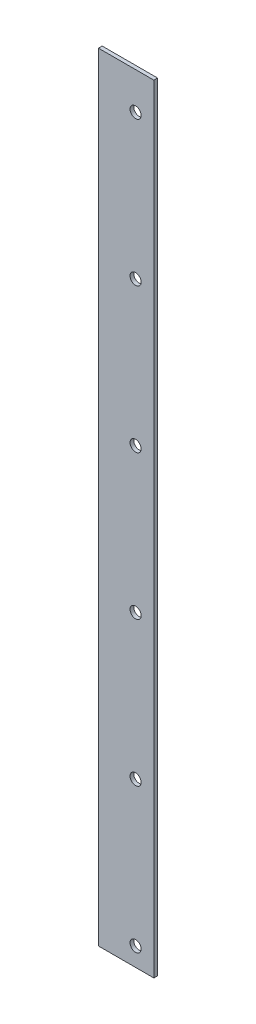
ISO-10303-21;
HEADER;
FILE_DESCRIPTION(('STEP AP214'),'2;1');
FILE_NAME('part.step','',(''),(''),'','','');
FILE_SCHEMA(('AUTOMOTIVE_DESIGN { 1 0 10303 214 1 1 1 1 }'));
ENDSEC;
DATA;
#1=APPLICATION_CONTEXT('core data for automotive mechanical design processes');
#2=APPLICATION_PROTOCOL_DEFINITION('international standard','automotive_design',2000,#1);
#3=PRODUCT_CONTEXT('',#1,'mechanical');
#4=PRODUCT('Part','Part','',(#3));
#5=PRODUCT_RELATED_PRODUCT_CATEGORY('part','',(#4));
#6=PRODUCT_DEFINITION_FORMATION('','',#4);
#7=PRODUCT_DEFINITION_CONTEXT('part definition',#1,'design');
#8=PRODUCT_DEFINITION('design','',#6,#7);
#9=PRODUCT_DEFINITION_SHAPE('','',#8);
#10=(LENGTH_UNIT() NAMED_UNIT(*) SI_UNIT(.MILLI.,.METRE.));
#11=(NAMED_UNIT(*) PLANE_ANGLE_UNIT() SI_UNIT($,.RADIAN.));
#12=(NAMED_UNIT(*) SI_UNIT($,.STERADIAN.) SOLID_ANGLE_UNIT());
#13=UNCERTAINTY_MEASURE_WITH_UNIT(LENGTH_MEASURE(1.E-05),#10,'distance_accuracy_value','');
#14=(GEOMETRIC_REPRESENTATION_CONTEXT(3) GLOBAL_UNCERTAINTY_ASSIGNED_CONTEXT((#13)) GLOBAL_UNIT_ASSIGNED_CONTEXT((#10,
#11,#12)) REPRESENTATION_CONTEXT('',''));
#15=CARTESIAN_POINT('',(0.,0.,0.));
#16=DIRECTION('',(0.,0.,1.));
#17=DIRECTION('',(1.,0.,0.));
#18=AXIS2_PLACEMENT_3D('',#15,#16,#17);
#19=CARTESIAN_POINT('',(11558.6922390228,488.999999999901,26699.8257165079));
#20=DIRECTION('',(0.,0.,-1.));
#21=DIRECTION('',(-1.,0.,0.));
#22=AXIS2_PLACEMENT_3D('',#19,#20,#21);
#23=PLANE('',#22);
#24=DIRECTION('',(1.,0.,0.));
#25=VECTOR('',#24,1.);
#26=CARTESIAN_POINT('',(11543.6922390228,910.,26699.8257165079));
#27=LINE('',#26,#25);
#28=CARTESIAN_POINT('',(11558.6922390228,910.,26699.8257165079));
#29=VERTEX_POINT('',#28);
#30=CARTESIAN_POINT('',(11528.6922390228,910.,26699.8257165079));
#31=VERTEX_POINT('',#30);
#32=EDGE_CURVE('E72',#29,#31,#27,.F.);
#33=ORIENTED_EDGE('',*,*,#32,.F.);
#34=DIRECTION('',(0.,1.,0.));
#35=VECTOR('',#34,1.);
#36=CARTESIAN_POINT('',(11558.6922390228,488.999999999901,26699.8257165079));
#37=LINE('',#36,#35);
#38=CARTESIAN_POINT('',(11558.6922390228,488.999999999901,26699.8257165079));
#39=VERTEX_POINT('',#38);
#40=EDGE_CURVE('E55',#39,#29,#37,.T.);
#41=ORIENTED_EDGE('',*,*,#40,.F.);
#42=DIRECTION('',(1.,0.,0.));
#43=VECTOR('',#42,1.);
#44=CARTESIAN_POINT('',(11543.6922390228,488.999999999901,26699.8257165079));
#45=LINE('',#44,#43);
#46=CARTESIAN_POINT('',(11528.6922390228,488.999999999901,26699.8257165079));
#47=VERTEX_POINT('',#46);
#48=EDGE_CURVE('E60',#39,#47,#45,.F.);
#49=ORIENTED_EDGE('',*,*,#48,.T.);
#50=DIRECTION('',(0.,1.,0.));
#51=VECTOR('',#50,1.);
#52=CARTESIAN_POINT('',(11528.6922390228,488.999999999901,26699.8257165079));
#53=LINE('',#52,#51);
#54=EDGE_CURVE('E102',#31,#47,#53,.F.);
#55=ORIENTED_EDGE('',*,*,#54,.F.);
#56=EDGE_LOOP('',(#33,#41,#49,#55));
#57=FACE_BOUND('',#56,.T.);
#58=CARTESIAN_POINT('',(11548.8037727152,577.272727272728,26699.8257165079));
#59=DIRECTION('',(0.,0.,1.));
#60=DIRECTION('',(1.,0.,0.));
#61=AXIS2_PLACEMENT_3D('',#58,#59,#60);
#62=CIRCLE('',#61,3.00000000001032);
#63=CARTESIAN_POINT('',(11551.8037727153,577.272727272728,26699.8257165079));
#64=VERTEX_POINT('',#63);
#65=EDGE_CURVE('E69',#64,#64,#62,.T.);
#66=ORIENTED_EDGE('',*,*,#65,.T.);
#67=EDGE_LOOP('',(#66));
#68=FACE_BOUND('',#67,.T.);
#69=CARTESIAN_POINT('',(11548.8037727153,733.636363636364,26699.8257165079));
#70=DIRECTION('',(0.,0.,1.));
#71=DIRECTION('',(1.,0.,0.));
#72=AXIS2_PLACEMENT_3D('',#69,#70,#71);
#73=CIRCLE('',#72,3.00000000001032);
#74=CARTESIAN_POINT('',(11551.8037727153,733.636363636364,26699.8257165079));
#75=VERTEX_POINT('',#74);
#76=EDGE_CURVE('E105',#75,#75,#73,.T.);
#77=ORIENTED_EDGE('',*,*,#76,.T.);
#78=EDGE_LOOP('',(#77));
#79=FACE_BOUND('',#78,.T.);
#80=CARTESIAN_POINT('',(11548.8037727152,890.,26699.8257165079));
#81=DIRECTION('',(0.,0.,1.));
#82=DIRECTION('',(1.,0.,0.));
#83=AXIS2_PLACEMENT_3D('',#80,#81,#82);
#84=CIRCLE('',#83,3.00000000001032);
#85=CARTESIAN_POINT('',(11551.8037727153,890.,26699.8257165079));
#86=VERTEX_POINT('',#85);
#87=EDGE_CURVE('E108',#86,#86,#84,.T.);
#88=ORIENTED_EDGE('',*,*,#87,.T.);
#89=EDGE_LOOP('',(#88));
#90=FACE_BOUND('',#89,.T.);
#91=CARTESIAN_POINT('',(11548.8037727152,811.818181818182,26699.8257165079));
#92=DIRECTION('',(0.,0.,1.));
#93=DIRECTION('',(1.,0.,0.));
#94=AXIS2_PLACEMENT_3D('',#91,#92,#93);
#95=CIRCLE('',#94,3.00000000001032);
#96=CARTESIAN_POINT('',(11551.8037727153,811.818181818182,26699.8257165079));
#97=VERTEX_POINT('',#96);
#98=EDGE_CURVE('E111',#97,#97,#95,.T.);
#99=ORIENTED_EDGE('',*,*,#98,.T.);
#100=EDGE_LOOP('',(#99));
#101=FACE_BOUND('',#100,.T.);
#102=CARTESIAN_POINT('',(11548.8037727152,655.454545454546,26699.8257165079));
#103=DIRECTION('',(0.,0.,1.));
#104=DIRECTION('',(1.,0.,0.));
#105=AXIS2_PLACEMENT_3D('',#102,#103,#104);
#106=CIRCLE('',#105,3.00000000001032);
#107=CARTESIAN_POINT('',(11551.8037727153,655.454545454546,26699.8257165079));
#108=VERTEX_POINT('',#107);
#109=EDGE_CURVE('E113',#108,#108,#106,.T.);
#110=ORIENTED_EDGE('',*,*,#109,.T.);
#111=EDGE_LOOP('',(#110));
#112=FACE_BOUND('',#111,.T.);
#113=CARTESIAN_POINT('',(11548.8037727152,499.090909090909,26699.8257165079));
#114=DIRECTION('',(0.,0.,1.));
#115=DIRECTION('',(1.,0.,0.));
#116=AXIS2_PLACEMENT_3D('',#113,#114,#115);
#117=CIRCLE('',#116,3.00000000001032);
#118=CARTESIAN_POINT('',(11551.8037727153,499.090909090909,26699.8257165079));
#119=VERTEX_POINT('',#118);
#120=EDGE_CURVE('E20',#119,#119,#117,.T.);
#121=ORIENTED_EDGE('',*,*,#120,.T.);
#122=EDGE_LOOP('',(#121));
#123=FACE_BOUND('',#122,.T.);
#124=ADVANCED_FACE('F17',(#57,#68,#79,#90,#101,#112,#123),#23,.T.);
#125=CARTESIAN_POINT('',(11548.8037727152,499.090909090909,26699.8257165079));
#126=DIRECTION('',(0.,0.,1.));
#127=DIRECTION('',(1.,0.,0.));
#128=AXIS2_PLACEMENT_3D('',#125,#126,#127);
#129=CYLINDRICAL_SURFACE('',#128,3.00000000001032);
#130=ORIENTED_EDGE('',*,*,#120,.F.);
#131=EDGE_LOOP('',(#130));
#132=FACE_BOUND('',#131,.T.);
#133=CARTESIAN_POINT('',(11548.8037727152,499.090909090909,26701.8257165079));
#134=DIRECTION('',(0.,0.,1.));
#135=DIRECTION('',(1.,0.,0.));
#136=AXIS2_PLACEMENT_3D('',#133,#134,#135);
#137=CIRCLE('',#136,3.00000000001032);
#138=CARTESIAN_POINT('',(11551.8037727153,499.090909090909,26701.8257165079));
#139=VERTEX_POINT('',#138);
#140=EDGE_CURVE('E99',#139,#139,#137,.F.);
#141=ORIENTED_EDGE('',*,*,#140,.F.);
#142=EDGE_LOOP('',(#141));
#143=FACE_BOUND('',#142,.T.);
#144=ADVANCED_FACE('F121',(#132,#143),#129,.F.);
#145=CARTESIAN_POINT('',(11548.8037727152,655.454545454546,26699.8257165079));
#146=DIRECTION('',(0.,0.,1.));
#147=DIRECTION('',(1.,0.,0.));
#148=AXIS2_PLACEMENT_3D('',#145,#146,#147);
#149=CYLINDRICAL_SURFACE('',#148,3.00000000001032);
#150=ORIENTED_EDGE('',*,*,#109,.F.);
#151=EDGE_LOOP('',(#150));
#152=FACE_BOUND('',#151,.T.);
#153=CARTESIAN_POINT('',(11548.8037727152,655.454545454546,26701.8257165079));
#154=DIRECTION('',(0.,0.,1.));
#155=DIRECTION('',(1.,0.,0.));
#156=AXIS2_PLACEMENT_3D('',#153,#154,#155);
#157=CIRCLE('',#156,3.00000000001032);
#158=CARTESIAN_POINT('',(11551.8037727153,655.454545454546,26701.8257165079));
#159=VERTEX_POINT('',#158);
#160=EDGE_CURVE('E96',#159,#159,#157,.F.);
#161=ORIENTED_EDGE('',*,*,#160,.F.);
#162=EDGE_LOOP('',(#161));
#163=FACE_BOUND('',#162,.T.);
#164=ADVANCED_FACE('F124',(#152,#163),#149,.F.);
#165=CARTESIAN_POINT('',(11548.8037727152,811.818181818182,26699.8257165079));
#166=DIRECTION('',(0.,0.,1.));
#167=DIRECTION('',(1.,0.,0.));
#168=AXIS2_PLACEMENT_3D('',#165,#166,#167);
#169=CYLINDRICAL_SURFACE('',#168,3.00000000001032);
#170=ORIENTED_EDGE('',*,*,#98,.F.);
#171=EDGE_LOOP('',(#170));
#172=FACE_BOUND('',#171,.T.);
#173=CARTESIAN_POINT('',(11548.8037727152,811.818181818182,26701.8257165079));
#174=DIRECTION('',(0.,0.,1.));
#175=DIRECTION('',(1.,0.,0.));
#176=AXIS2_PLACEMENT_3D('',#173,#174,#175);
#177=CIRCLE('',#176,3.00000000001032);
#178=CARTESIAN_POINT('',(11551.8037727153,811.818181818182,26701.8257165079));
#179=VERTEX_POINT('',#178);
#180=EDGE_CURVE('E93',#179,#179,#177,.F.);
#181=ORIENTED_EDGE('',*,*,#180,.F.);
#182=EDGE_LOOP('',(#181));
#183=FACE_BOUND('',#182,.T.);
#184=ADVANCED_FACE('F159',(#172,#183),#169,.F.);
#185=CARTESIAN_POINT('',(11548.8037727152,890.,26699.8257165079));
#186=DIRECTION('',(0.,0.,1.));
#187=DIRECTION('',(1.,0.,0.));
#188=AXIS2_PLACEMENT_3D('',#185,#186,#187);
#189=CYLINDRICAL_SURFACE('',#188,3.00000000001032);
#190=ORIENTED_EDGE('',*,*,#87,.F.);
#191=EDGE_LOOP('',(#190));
#192=FACE_BOUND('',#191,.T.);
#193=CARTESIAN_POINT('',(11548.8037727152,890.,26701.8257165079));
#194=DIRECTION('',(0.,0.,1.));
#195=DIRECTION('',(1.,0.,0.));
#196=AXIS2_PLACEMENT_3D('',#193,#194,#195);
#197=CIRCLE('',#196,3.00000000001032);
#198=CARTESIAN_POINT('',(11551.8037727153,890.,26701.8257165079));
#199=VERTEX_POINT('',#198);
#200=EDGE_CURVE('E90',#199,#199,#197,.F.);
#201=ORIENTED_EDGE('',*,*,#200,.F.);
#202=EDGE_LOOP('',(#201));
#203=FACE_BOUND('',#202,.T.);
#204=ADVANCED_FACE('F155',(#192,#203),#189,.F.);
#205=CARTESIAN_POINT('',(11548.8037727153,733.636363636364,26699.8257165079));
#206=DIRECTION('',(0.,0.,1.));
#207=DIRECTION('',(1.,0.,0.));
#208=AXIS2_PLACEMENT_3D('',#205,#206,#207);
#209=CYLINDRICAL_SURFACE('',#208,3.00000000001032);
#210=ORIENTED_EDGE('',*,*,#76,.F.);
#211=EDGE_LOOP('',(#210));
#212=FACE_BOUND('',#211,.T.);
#213=CARTESIAN_POINT('',(11548.8037727153,733.636363636364,26701.8257165079));
#214=DIRECTION('',(0.,0.,1.));
#215=DIRECTION('',(1.,0.,0.));
#216=AXIS2_PLACEMENT_3D('',#213,#214,#215);
#217=CIRCLE('',#216,3.00000000001032);
#218=CARTESIAN_POINT('',(11551.8037727153,733.636363636364,26701.8257165079));
#219=VERTEX_POINT('',#218);
#220=EDGE_CURVE('E87',#219,#219,#217,.F.);
#221=ORIENTED_EDGE('',*,*,#220,.F.);
#222=EDGE_LOOP('',(#221));
#223=FACE_BOUND('',#222,.T.);
#224=ADVANCED_FACE('F151',(#212,#223),#209,.F.);
#225=CARTESIAN_POINT('',(11548.8037727152,577.272727272728,26699.8257165079));
#226=DIRECTION('',(0.,0.,1.));
#227=DIRECTION('',(1.,0.,0.));
#228=AXIS2_PLACEMENT_3D('',#225,#226,#227);
#229=CYLINDRICAL_SURFACE('',#228,3.00000000001032);
#230=ORIENTED_EDGE('',*,*,#65,.F.);
#231=EDGE_LOOP('',(#230));
#232=FACE_BOUND('',#231,.T.);
#233=CARTESIAN_POINT('',(11548.8037727152,577.272727272728,26701.8257165079));
#234=DIRECTION('',(0.,0.,1.));
#235=DIRECTION('',(1.,0.,0.));
#236=AXIS2_PLACEMENT_3D('',#233,#234,#235);
#237=CIRCLE('',#236,3.00000000001032);
#238=CARTESIAN_POINT('',(11551.8037727153,577.272727272728,26701.8257165079));
#239=VERTEX_POINT('',#238);
#240=EDGE_CURVE('E83',#239,#239,#237,.F.);
#241=ORIENTED_EDGE('',*,*,#240,.F.);
#242=EDGE_LOOP('',(#241));
#243=FACE_BOUND('',#242,.T.);
#244=ADVANCED_FACE('F148',(#232,#243),#229,.F.);
#245=CARTESIAN_POINT('',(11543.6922390228,488.999999999901,26700.8257165079));
#246=DIRECTION('',(0.,1.,0.));
#247=DIRECTION('',(0.,0.,1.));
#248=AXIS2_PLACEMENT_3D('',#245,#246,#247);
#249=PLANE('',#248);
#250=ORIENTED_EDGE('',*,*,#48,.F.);
#251=DIRECTION('',(0.,0.,1.));
#252=VECTOR('',#251,1.);
#253=CARTESIAN_POINT('',(11558.6922390228,488.999999999901,26701.8257165079));
#254=LINE('',#253,#252);
#255=CARTESIAN_POINT('',(11558.6922390228,488.999999999901,26701.8257165079));
#256=VERTEX_POINT('',#255);
#257=EDGE_CURVE('E62',#256,#39,#254,.F.);
#258=ORIENTED_EDGE('',*,*,#257,.F.);
#259=DIRECTION('',(1.,0.,0.));
#260=VECTOR('',#259,1.);
#261=CARTESIAN_POINT('',(11528.6922390228,488.999999999901,26701.8257165079));
#262=LINE('',#261,#260);
#263=CARTESIAN_POINT('',(11528.6922390228,488.999999999901,26701.8257165079));
#264=VERTEX_POINT('',#263);
#265=EDGE_CURVE('E86',#264,#256,#262,.T.);
#266=ORIENTED_EDGE('',*,*,#265,.F.);
#267=DIRECTION('',(-5.62933033521062E-12,0.,1.));
#268=VECTOR('',#267,1.);
#269=CARTESIAN_POINT('',(11528.6922390228,488.999999999901,26699.8257165079));
#270=LINE('',#269,#268);
#271=EDGE_CURVE('E65',#47,#264,#270,.T.);
#272=ORIENTED_EDGE('',*,*,#271,.F.);
#273=EDGE_LOOP('',(#250,#258,#266,#272));
#274=FACE_BOUND('',#273,.T.);
#275=ADVANCED_FACE('F61',(#274),#249,.F.);
#276=CARTESIAN_POINT('',(11558.6922390228,488.999999999901,26701.8257165079));
#277=DIRECTION('',(1.,0.,0.));
#278=DIRECTION('',(0.,1.,0.));
#279=AXIS2_PLACEMENT_3D('',#276,#277,#278);
#280=PLANE('',#279);
#281=DIRECTION('',(0.,0.,1.));
#282=VECTOR('',#281,1.);
#283=CARTESIAN_POINT('',(11558.6922390228,910.,26700.8257165079));
#284=LINE('',#283,#282);
#285=CARTESIAN_POINT('',(11558.6922390228,910.,26701.8257165079));
#286=VERTEX_POINT('',#285);
#287=EDGE_CURVE('E74',#286,#29,#284,.F.);
#288=ORIENTED_EDGE('',*,*,#287,.F.);
#289=DIRECTION('',(0.,-1.,0.));
#290=VECTOR('',#289,1.);
#291=CARTESIAN_POINT('',(11558.6922390228,488.999999999901,26701.8257165079));
#292=LINE('',#291,#290);
#293=EDGE_CURVE('E78',#256,#286,#292,.F.);
#294=ORIENTED_EDGE('',*,*,#293,.F.);
#295=ORIENTED_EDGE('',*,*,#257,.T.);
#296=ORIENTED_EDGE('',*,*,#40,.T.);
#297=EDGE_LOOP('',(#288,#294,#295,#296));
#298=FACE_BOUND('',#297,.T.);
#299=ADVANCED_FACE('F76',(#298),#280,.T.);
#300=CARTESIAN_POINT('',(11543.6922390228,910.,26700.8257165079));
#301=DIRECTION('',(0.,1.,0.));
#302=DIRECTION('',(0.,0.,1.));
#303=AXIS2_PLACEMENT_3D('',#300,#301,#302);
#304=PLANE('',#303);
#305=ORIENTED_EDGE('',*,*,#287,.T.);
#306=ORIENTED_EDGE('',*,*,#32,.T.);
#307=DIRECTION('',(-5.62933033521062E-12,0.,1.));
#308=VECTOR('',#307,1.);
#309=CARTESIAN_POINT('',(11528.6922390228,910.,26699.8257165079));
#310=LINE('',#309,#308);
#311=CARTESIAN_POINT('',(11528.6922390228,910.,26701.8257165079));
#312=VERTEX_POINT('',#311);
#313=EDGE_CURVE('E35',#312,#31,#310,.F.);
#314=ORIENTED_EDGE('',*,*,#313,.F.);
#315=DIRECTION('',(1.,0.,0.));
#316=VECTOR('',#315,1.);
#317=CARTESIAN_POINT('',(11528.6922390228,910.,26701.8257165079));
#318=LINE('',#317,#316);
#319=EDGE_CURVE('E26',#286,#312,#318,.F.);
#320=ORIENTED_EDGE('',*,*,#319,.F.);
#321=EDGE_LOOP('',(#305,#306,#314,#320));
#322=FACE_BOUND('',#321,.T.);
#323=ADVANCED_FACE('F136',(#322),#304,.T.);
#324=CARTESIAN_POINT('',(11528.6922390228,488.999999999901,26699.8257165079));
#325=DIRECTION('',(-1.,0.,-5.62933033521062E-12));
#326=DIRECTION('',(-5.62933033521062E-12,0.,1.));
#327=AXIS2_PLACEMENT_3D('',#324,#325,#326);
#328=PLANE('',#327);
#329=ORIENTED_EDGE('',*,*,#313,.T.);
#330=ORIENTED_EDGE('',*,*,#54,.T.);
#331=ORIENTED_EDGE('',*,*,#271,.T.);
#332=DIRECTION('',(0.,-1.,0.));
#333=VECTOR('',#332,1.);
#334=CARTESIAN_POINT('',(11528.6922390228,488.999999999901,26701.8257165079));
#335=LINE('',#334,#333);
#336=EDGE_CURVE('E11',#312,#264,#335,.T.);
#337=ORIENTED_EDGE('',*,*,#336,.F.);
#338=EDGE_LOOP('',(#329,#330,#331,#337));
#339=FACE_BOUND('',#338,.T.);
#340=ADVANCED_FACE('F129',(#339),#328,.T.);
#341=CARTESIAN_POINT('',(11528.6922390228,488.999999999901,26701.8257165079));
#342=DIRECTION('',(0.,0.,1.));
#343=DIRECTION('',(0.,-1.,0.));
#344=AXIS2_PLACEMENT_3D('',#341,#342,#343);
#345=PLANE('',#344);
#346=ORIENTED_EDGE('',*,*,#319,.T.);
#347=ORIENTED_EDGE('',*,*,#336,.T.);
#348=ORIENTED_EDGE('',*,*,#265,.T.);
#349=ORIENTED_EDGE('',*,*,#293,.T.);
#350=EDGE_LOOP('',(#346,#347,#348,#349));
#351=FACE_BOUND('',#350,.T.);
#352=ORIENTED_EDGE('',*,*,#240,.T.);
#353=EDGE_LOOP('',(#352));
#354=FACE_BOUND('',#353,.T.);
#355=ORIENTED_EDGE('',*,*,#220,.T.);
#356=EDGE_LOOP('',(#355));
#357=FACE_BOUND('',#356,.T.);
#358=ORIENTED_EDGE('',*,*,#200,.T.);
#359=EDGE_LOOP('',(#358));
#360=FACE_BOUND('',#359,.T.);
#361=ORIENTED_EDGE('',*,*,#180,.T.);
#362=EDGE_LOOP('',(#361));
#363=FACE_BOUND('',#362,.T.);
#364=ORIENTED_EDGE('',*,*,#160,.T.);
#365=EDGE_LOOP('',(#364));
#366=FACE_BOUND('',#365,.T.);
#367=ORIENTED_EDGE('',*,*,#140,.T.);
#368=EDGE_LOOP('',(#367));
#369=FACE_BOUND('',#368,.T.);
#370=ADVANCED_FACE('F127',(#351,#354,#357,#360,#363,#366,#369),#345,.T.);
#371=CLOSED_SHELL('',(#124,#144,#164,#184,#204,#224,#244,#275,#299,#323,#340,#370));
#372=MANIFOLD_SOLID_BREP('B1',#371);
#373=ADVANCED_BREP_SHAPE_REPRESENTATION('',(#18,#372),#14);
#374=SHAPE_DEFINITION_REPRESENTATION(#9,#373);
ENDSEC;
END-ISO-10303-21;
